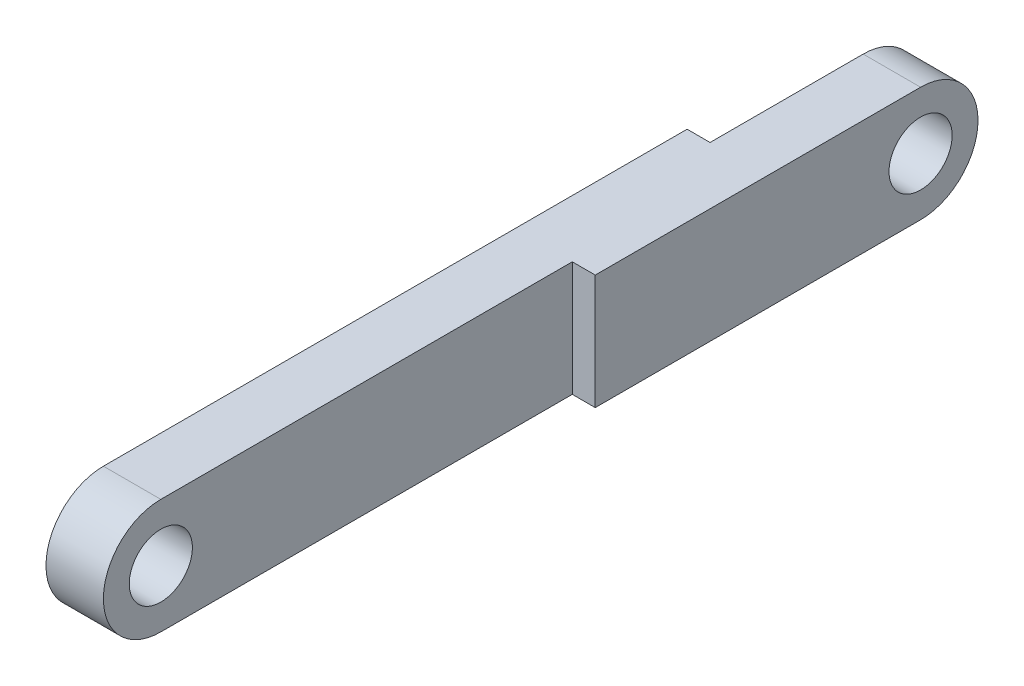
ISO-10303-21;
HEADER;
FILE_DESCRIPTION(('STEP AP214'),'2;1');
FILE_NAME('part.step','',(''),(''),'','','');
FILE_SCHEMA(('AUTOMOTIVE_DESIGN { 1 0 10303 214 1 1 1 1 }'));
ENDSEC;
DATA;
#1=APPLICATION_CONTEXT('core data for automotive mechanical design processes');
#2=APPLICATION_PROTOCOL_DEFINITION('international standard','automotive_design',2000,#1);
#3=PRODUCT_CONTEXT('',#1,'mechanical');
#4=PRODUCT('Part','Part','',(#3));
#5=PRODUCT_RELATED_PRODUCT_CATEGORY('part','',(#4));
#6=PRODUCT_DEFINITION_FORMATION('','',#4);
#7=PRODUCT_DEFINITION_CONTEXT('part definition',#1,'design');
#8=PRODUCT_DEFINITION('design','',#6,#7);
#9=PRODUCT_DEFINITION_SHAPE('','',#8);
#10=(LENGTH_UNIT() NAMED_UNIT(*) SI_UNIT(.MILLI.,.METRE.));
#11=(NAMED_UNIT(*) PLANE_ANGLE_UNIT() SI_UNIT($,.RADIAN.));
#12=(NAMED_UNIT(*) SI_UNIT($,.STERADIAN.) SOLID_ANGLE_UNIT());
#13=UNCERTAINTY_MEASURE_WITH_UNIT(LENGTH_MEASURE(1.E-05),#10,'distance_accuracy_value','');
#14=(GEOMETRIC_REPRESENTATION_CONTEXT(3) GLOBAL_UNCERTAINTY_ASSIGNED_CONTEXT((#13)) GLOBAL_UNIT_ASSIGNED_CONTEXT((#10,
#11,#12)) REPRESENTATION_CONTEXT('',''));
#15=CARTESIAN_POINT('',(0.,0.,0.));
#16=DIRECTION('',(0.,0.,1.));
#17=DIRECTION('',(1.,0.,0.));
#18=AXIS2_PLACEMENT_3D('',#15,#16,#17);
#19=CARTESIAN_POINT('',(3.,0.,0.));
#20=DIRECTION('',(1.,0.,0.));
#21=DIRECTION('',(0.,0.,-1.));
#22=AXIS2_PLACEMENT_3D('',#19,#20,#21);
#23=PLANE('',#22);
#24=DIRECTION('',(0.,-1.,0.));
#25=VECTOR('',#24,1.);
#26=CARTESIAN_POINT('',(3.,0.,-21.5));
#27=LINE('',#26,#25);
#28=CARTESIAN_POINT('',(3.,3.,-21.5));
#29=VERTEX_POINT('',#28);
#30=CARTESIAN_POINT('',(3.,-3.,-21.5));
#31=VERTEX_POINT('',#30);
#32=EDGE_CURVE('E66',#29,#31,#27,.T.);
#33=ORIENTED_EDGE('',*,*,#32,.F.);
#34=DIRECTION('',(0.,0.,1.));
#35=VECTOR('',#34,1.);
#36=CARTESIAN_POINT('',(3.,3.,0.));
#37=LINE('',#36,#35);
#38=CARTESIAN_POINT('',(3.,3.,0.));
#39=VERTEX_POINT('',#38);
#40=EDGE_CURVE('E144',#29,#39,#37,.T.);
#41=ORIENTED_EDGE('',*,*,#40,.T.);
#42=CARTESIAN_POINT('',(3.,0.,0.));
#43=DIRECTION('',(1.,0.,0.));
#44=DIRECTION('',(0.,0.,-1.));
#45=AXIS2_PLACEMENT_3D('',#42,#43,#44);
#46=CIRCLE('',#45,3.);
#47=CARTESIAN_POINT('',(3.,-3.,0.));
#48=VERTEX_POINT('',#47);
#49=EDGE_CURVE('E181',#39,#48,#46,.T.);
#50=ORIENTED_EDGE('',*,*,#49,.T.);
#51=DIRECTION('',(0.,0.,-1.));
#52=VECTOR('',#51,1.);
#53=CARTESIAN_POINT('',(3.,-3.,0.));
#54=LINE('',#53,#52);
#55=EDGE_CURVE('E185',#48,#31,#54,.T.);
#56=ORIENTED_EDGE('',*,*,#55,.T.);
#57=EDGE_LOOP('',(#33,#41,#50,#56));
#58=FACE_BOUND('',#57,.T.);
#59=CARTESIAN_POINT('',(3.,0.,0.));
#60=DIRECTION('',(1.,0.,0.));
#61=DIRECTION('',(0.,0.,-1.));
#62=AXIS2_PLACEMENT_3D('',#59,#60,#61);
#63=CIRCLE('',#62,1.65);
#64=CARTESIAN_POINT('',(3.,0.,-1.65));
#65=VERTEX_POINT('',#64);
#66=EDGE_CURVE('E173',#65,#65,#63,.T.);
#67=ORIENTED_EDGE('',*,*,#66,.F.);
#68=EDGE_LOOP('',(#67));
#69=FACE_BOUND('',#68,.T.);
#70=ADVANCED_FACE('F49',(#58,#69),#23,.T.);
#71=CARTESIAN_POINT('',(0.,0.,0.));
#72=DIRECTION('',(1.,0.,0.));
#73=DIRECTION('',(0.,0.,-1.));
#74=AXIS2_PLACEMENT_3D('',#71,#72,#73);
#75=PLANE('',#74);
#76=DIRECTION('',(0.,0.,1.));
#77=VECTOR('',#76,1.);
#78=CARTESIAN_POINT('',(0.,3.,0.));
#79=LINE('',#78,#77);
#80=CARTESIAN_POINT('',(0.,3.,-30.5));
#81=VERTEX_POINT('',#80);
#82=CARTESIAN_POINT('',(0.,3.,0.));
#83=VERTEX_POINT('',#82);
#84=EDGE_CURVE('E186',#81,#83,#79,.T.);
#85=ORIENTED_EDGE('',*,*,#84,.F.);
#86=DIRECTION('',(0.,1.,0.));
#87=VECTOR('',#86,1.);
#88=CARTESIAN_POINT('',(0.,3.,-30.5));
#89=LINE('',#88,#87);
#90=CARTESIAN_POINT('',(0.,-3.,-30.5));
#91=VERTEX_POINT('',#90);
#92=EDGE_CURVE('E146',#91,#81,#89,.T.);
#93=ORIENTED_EDGE('',*,*,#92,.F.);
#94=DIRECTION('',(0.,0.,-1.));
#95=VECTOR('',#94,1.);
#96=CARTESIAN_POINT('',(0.,-3.,0.));
#97=LINE('',#96,#95);
#98=CARTESIAN_POINT('',(0.,-3.,0.));
#99=VERTEX_POINT('',#98);
#100=EDGE_CURVE('E195',#99,#91,#97,.T.);
#101=ORIENTED_EDGE('',*,*,#100,.F.);
#102=CARTESIAN_POINT('',(0.,0.,0.));
#103=DIRECTION('',(1.,0.,0.));
#104=DIRECTION('',(0.,0.,-1.));
#105=AXIS2_PLACEMENT_3D('',#102,#103,#104);
#106=CIRCLE('',#105,3.);
#107=EDGE_CURVE('E177',#83,#99,#106,.T.);
#108=ORIENTED_EDGE('',*,*,#107,.F.);
#109=EDGE_LOOP('',(#85,#93,#101,#108));
#110=FACE_BOUND('',#109,.T.);
#111=CARTESIAN_POINT('',(0.,0.,0.));
#112=DIRECTION('',(1.,0.,0.));
#113=DIRECTION('',(0.,0.,-1.));
#114=AXIS2_PLACEMENT_3D('',#111,#112,#113);
#115=CIRCLE('',#114,1.65);
#116=CARTESIAN_POINT('',(0.,0.,-1.65));
#117=VERTEX_POINT('',#116);
#118=EDGE_CURVE('E172',#117,#117,#115,.T.);
#119=ORIENTED_EDGE('',*,*,#118,.T.);
#120=EDGE_LOOP('',(#119));
#121=FACE_BOUND('',#120,.T.);
#122=ADVANCED_FACE('F243',(#110,#121),#75,.F.);
#123=CARTESIAN_POINT('',(3.,0.,0.));
#124=DIRECTION('',(-1.,0.,0.));
#125=DIRECTION('',(0.,0.,1.));
#126=AXIS2_PLACEMENT_3D('',#123,#124,#125);
#127=CYLINDRICAL_SURFACE('',#126,3.);
#128=ORIENTED_EDGE('',*,*,#107,.T.);
#129=DIRECTION('',(-1.,0.,0.));
#130=VECTOR('',#129,1.);
#131=CARTESIAN_POINT('',(3.,-3.,0.));
#132=LINE('',#131,#130);
#133=EDGE_CURVE('E11',#48,#99,#132,.T.);
#134=ORIENTED_EDGE('',*,*,#133,.F.);
#135=ORIENTED_EDGE('',*,*,#49,.F.);
#136=DIRECTION('',(-1.,0.,0.));
#137=VECTOR('',#136,1.);
#138=CARTESIAN_POINT('',(3.,3.,0.));
#139=LINE('',#138,#137);
#140=EDGE_CURVE('E191',#39,#83,#139,.T.);
#141=ORIENTED_EDGE('',*,*,#140,.T.);
#142=EDGE_LOOP('',(#128,#134,#135,#141));
#143=FACE_BOUND('',#142,.T.);
#144=ADVANCED_FACE('F51',(#143),#127,.T.);
#145=CARTESIAN_POINT('',(3.,-3.,0.));
#146=DIRECTION('',(0.,1.,0.));
#147=DIRECTION('',(0.,0.,1.));
#148=AXIS2_PLACEMENT_3D('',#145,#146,#147);
#149=PLANE('',#148);
#150=ORIENTED_EDGE('',*,*,#100,.T.);
#151=DIRECTION('',(-1.,0.,0.));
#152=VECTOR('',#151,1.);
#153=CARTESIAN_POINT('',(1.2,-3.,-30.5));
#154=LINE('',#153,#152);
#155=CARTESIAN_POINT('',(1.2,-3.,-30.5));
#156=VERTEX_POINT('',#155);
#157=EDGE_CURVE('E161',#156,#91,#154,.T.);
#158=ORIENTED_EDGE('',*,*,#157,.F.);
#159=DIRECTION('',(0.,0.,1.));
#160=VECTOR('',#159,1.);
#161=CARTESIAN_POINT('',(1.2,-3.,-30.5));
#162=LINE('',#161,#160);
#163=CARTESIAN_POINT('',(1.2,-3.,-38.5));
#164=VERTEX_POINT('',#163);
#165=EDGE_CURVE('E150',#164,#156,#162,.T.);
#166=ORIENTED_EDGE('',*,*,#165,.F.);
#167=DIRECTION('',(-1.,0.,0.));
#168=VECTOR('',#167,1.);
#169=CARTESIAN_POINT('',(3.,-3.,-38.5));
#170=LINE('',#169,#168);
#171=CARTESIAN_POINT('',(4.2,-3.,-38.5));
#172=VERTEX_POINT('',#171);
#173=EDGE_CURVE('E59',#172,#164,#170,.T.);
#174=ORIENTED_EDGE('',*,*,#173,.F.);
#175=DIRECTION('',(0.,0.,-1.));
#176=VECTOR('',#175,1.);
#177=CARTESIAN_POINT('',(4.2,-3.,0.));
#178=LINE('',#177,#176);
#179=CARTESIAN_POINT('',(4.2,-3.,-21.5));
#180=VERTEX_POINT('',#179);
#181=EDGE_CURVE('E128',#180,#172,#178,.T.);
#182=ORIENTED_EDGE('',*,*,#181,.F.);
#183=DIRECTION('',(-1.,0.,0.));
#184=VECTOR('',#183,1.);
#185=CARTESIAN_POINT('',(4.2,-3.,-21.5));
#186=LINE('',#185,#184);
#187=EDGE_CURVE('E123',#180,#31,#186,.T.);
#188=ORIENTED_EDGE('',*,*,#187,.T.);
#189=ORIENTED_EDGE('',*,*,#55,.F.);
#190=ORIENTED_EDGE('',*,*,#133,.T.);
#191=EDGE_LOOP('',(#150,#158,#166,#174,#182,#188,#189,#190));
#192=FACE_BOUND('',#191,.T.);
#193=ADVANCED_FACE('F213',(#192),#149,.F.);
#194=CARTESIAN_POINT('',(3.,0.,-38.5));
#195=DIRECTION('',(-1.,0.,0.));
#196=DIRECTION('',(0.,0.,1.));
#197=AXIS2_PLACEMENT_3D('',#194,#195,#196);
#198=CYLINDRICAL_SURFACE('',#197,3.);
#199=CARTESIAN_POINT('',(1.2,0.,-38.5));
#200=DIRECTION('',(1.,0.,0.));
#201=DIRECTION('',(0.,0.,-1.));
#202=AXIS2_PLACEMENT_3D('',#199,#200,#201);
#203=CIRCLE('',#202,3.);
#204=CARTESIAN_POINT('',(1.2,3.,-38.5));
#205=VERTEX_POINT('',#204);
#206=EDGE_CURVE('E169',#164,#205,#203,.T.);
#207=ORIENTED_EDGE('',*,*,#206,.T.);
#208=DIRECTION('',(-1.,0.,0.));
#209=VECTOR('',#208,1.);
#210=CARTESIAN_POINT('',(3.,3.,-38.5));
#211=LINE('',#210,#209);
#212=CARTESIAN_POINT('',(4.2,3.,-38.5));
#213=VERTEX_POINT('',#212);
#214=EDGE_CURVE('E204',#213,#205,#211,.T.);
#215=ORIENTED_EDGE('',*,*,#214,.F.);
#216=CARTESIAN_POINT('',(4.2,0.,-38.5));
#217=DIRECTION('',(1.,0.,0.));
#218=DIRECTION('',(0.,0.,-1.));
#219=AXIS2_PLACEMENT_3D('',#216,#217,#218);
#220=CIRCLE('',#219,3.);
#221=EDGE_CURVE('E135',#172,#213,#220,.T.);
#222=ORIENTED_EDGE('',*,*,#221,.F.);
#223=ORIENTED_EDGE('',*,*,#173,.T.);
#224=EDGE_LOOP('',(#207,#215,#222,#223));
#225=FACE_BOUND('',#224,.T.);
#226=ADVANCED_FACE('F210',(#225),#198,.T.);
#227=CARTESIAN_POINT('',(3.,3.,0.));
#228=DIRECTION('',(0.,-1.,0.));
#229=DIRECTION('',(0.,0.,-1.));
#230=AXIS2_PLACEMENT_3D('',#227,#228,#229);
#231=PLANE('',#230);
#232=DIRECTION('',(0.,0.,-1.));
#233=VECTOR('',#232,1.);
#234=CARTESIAN_POINT('',(1.2,3.,-41.5));
#235=LINE('',#234,#233);
#236=CARTESIAN_POINT('',(1.2,3.,-30.5));
#237=VERTEX_POINT('',#236);
#238=EDGE_CURVE('E159',#237,#205,#235,.T.);
#239=ORIENTED_EDGE('',*,*,#238,.F.);
#240=DIRECTION('',(-1.,0.,0.));
#241=VECTOR('',#240,1.);
#242=CARTESIAN_POINT('',(1.2,3.,-30.5));
#243=LINE('',#242,#241);
#244=EDGE_CURVE('E163',#237,#81,#243,.T.);
#245=ORIENTED_EDGE('',*,*,#244,.T.);
#246=ORIENTED_EDGE('',*,*,#84,.T.);
#247=ORIENTED_EDGE('',*,*,#140,.F.);
#248=ORIENTED_EDGE('',*,*,#40,.F.);
#249=DIRECTION('',(-1.,0.,0.));
#250=VECTOR('',#249,1.);
#251=CARTESIAN_POINT('',(4.2,3.,-21.5));
#252=LINE('',#251,#250);
#253=CARTESIAN_POINT('',(4.2,3.,-21.5));
#254=VERTEX_POINT('',#253);
#255=EDGE_CURVE('E121',#254,#29,#252,.T.);
#256=ORIENTED_EDGE('',*,*,#255,.F.);
#257=DIRECTION('',(0.,0.,1.));
#258=VECTOR('',#257,1.);
#259=CARTESIAN_POINT('',(4.2,3.,0.));
#260=LINE('',#259,#258);
#261=EDGE_CURVE('E129',#213,#254,#260,.T.);
#262=ORIENTED_EDGE('',*,*,#261,.F.);
#263=ORIENTED_EDGE('',*,*,#214,.T.);
#264=EDGE_LOOP('',(#239,#245,#246,#247,#248,#256,#262,#263));
#265=FACE_BOUND('',#264,.T.);
#266=ADVANCED_FACE('F142',(#265),#231,.F.);
#267=CARTESIAN_POINT('',(3.,0.,-38.5));
#268=DIRECTION('',(-1.,0.,0.));
#269=DIRECTION('',(0.,0.,1.));
#270=AXIS2_PLACEMENT_3D('',#267,#268,#269);
#271=CYLINDRICAL_SURFACE('',#270,1.65);
#272=CARTESIAN_POINT('',(1.2,0.,-38.5));
#273=DIRECTION('',(1.,0.,0.));
#274=DIRECTION('',(0.,0.,-1.));
#275=AXIS2_PLACEMENT_3D('',#272,#273,#274);
#276=CIRCLE('',#275,1.65);
#277=CARTESIAN_POINT('',(1.2,0.,-40.15));
#278=VERTEX_POINT('',#277);
#279=EDGE_CURVE('E53',#278,#278,#276,.T.);
#280=ORIENTED_EDGE('',*,*,#279,.F.);
#281=EDGE_LOOP('',(#280));
#282=FACE_BOUND('',#281,.T.);
#283=CARTESIAN_POINT('',(4.2,0.,-38.5));
#284=DIRECTION('',(1.,0.,0.));
#285=DIRECTION('',(0.,0.,-1.));
#286=AXIS2_PLACEMENT_3D('',#283,#284,#285);
#287=CIRCLE('',#286,1.65);
#288=CARTESIAN_POINT('',(4.2,0.,-40.15));
#289=VERTEX_POINT('',#288);
#290=EDGE_CURVE('E139',#289,#289,#287,.F.);
#291=ORIENTED_EDGE('',*,*,#290,.F.);
#292=EDGE_LOOP('',(#291));
#293=FACE_BOUND('',#292,.T.);
#294=ADVANCED_FACE('F226',(#282,#293),#271,.F.);
#295=CARTESIAN_POINT('',(3.,0.,0.));
#296=DIRECTION('',(-1.,0.,0.));
#297=DIRECTION('',(0.,0.,1.));
#298=AXIS2_PLACEMENT_3D('',#295,#296,#297);
#299=CYLINDRICAL_SURFACE('',#298,1.65);
#300=ORIENTED_EDGE('',*,*,#66,.T.);
#301=EDGE_LOOP('',(#300));
#302=FACE_BOUND('',#301,.T.);
#303=ORIENTED_EDGE('',*,*,#118,.F.);
#304=EDGE_LOOP('',(#303));
#305=FACE_BOUND('',#304,.T.);
#306=ADVANCED_FACE('F228',(#302,#305),#299,.F.);
#307=CARTESIAN_POINT('',(1.2,0.,0.));
#308=DIRECTION('',(1.,0.,0.));
#309=DIRECTION('',(0.,0.,-1.));
#310=AXIS2_PLACEMENT_3D('',#307,#308,#309);
#311=PLANE('',#310);
#312=ORIENTED_EDGE('',*,*,#279,.T.);
#313=EDGE_LOOP('',(#312));
#314=FACE_BOUND('',#313,.T.);
#315=ORIENTED_EDGE('',*,*,#206,.F.);
#316=ORIENTED_EDGE('',*,*,#165,.T.);
#317=DIRECTION('',(0.,1.,0.));
#318=VECTOR('',#317,1.);
#319=CARTESIAN_POINT('',(1.2,3.,-30.5));
#320=LINE('',#319,#318);
#321=EDGE_CURVE('E74',#156,#237,#320,.T.);
#322=ORIENTED_EDGE('',*,*,#321,.T.);
#323=ORIENTED_EDGE('',*,*,#238,.T.);
#324=EDGE_LOOP('',(#315,#316,#322,#323));
#325=FACE_BOUND('',#324,.T.);
#326=ADVANCED_FACE('F236',(#314,#325),#311,.F.);
#327=CARTESIAN_POINT('',(1.2,3.,-30.5));
#328=DIRECTION('',(0.,0.,1.));
#329=DIRECTION('',(1.,0.,0.));
#330=AXIS2_PLACEMENT_3D('',#327,#328,#329);
#331=PLANE('',#330);
#332=ORIENTED_EDGE('',*,*,#92,.T.);
#333=ORIENTED_EDGE('',*,*,#244,.F.);
#334=ORIENTED_EDGE('',*,*,#321,.F.);
#335=ORIENTED_EDGE('',*,*,#157,.T.);
#336=EDGE_LOOP('',(#332,#333,#334,#335));
#337=FACE_BOUND('',#336,.T.);
#338=ADVANCED_FACE('F267',(#337),#331,.F.);
#339=CARTESIAN_POINT('',(4.2,0.,-21.5));
#340=DIRECTION('',(0.,0.,-1.));
#341=DIRECTION('',(-1.,0.,0.));
#342=AXIS2_PLACEMENT_3D('',#339,#340,#341);
#343=PLANE('',#342);
#344=ORIENTED_EDGE('',*,*,#32,.T.);
#345=ORIENTED_EDGE('',*,*,#187,.F.);
#346=DIRECTION('',(0.,-1.,0.));
#347=VECTOR('',#346,1.);
#348=CARTESIAN_POINT('',(4.2,0.,-21.5));
#349=LINE('',#348,#347);
#350=EDGE_CURVE('E117',#254,#180,#349,.T.);
#351=ORIENTED_EDGE('',*,*,#350,.F.);
#352=ORIENTED_EDGE('',*,*,#255,.T.);
#353=EDGE_LOOP('',(#344,#345,#351,#352));
#354=FACE_BOUND('',#353,.T.);
#355=ADVANCED_FACE('F119',(#354),#343,.F.);
#356=CARTESIAN_POINT('',(4.2,0.,0.));
#357=DIRECTION('',(1.,0.,0.));
#358=DIRECTION('',(0.,0.,-1.));
#359=AXIS2_PLACEMENT_3D('',#356,#357,#358);
#360=PLANE('',#359);
#361=ORIENTED_EDGE('',*,*,#290,.T.);
#362=EDGE_LOOP('',(#361));
#363=FACE_BOUND('',#362,.T.);
#364=ORIENTED_EDGE('',*,*,#261,.T.);
#365=ORIENTED_EDGE('',*,*,#350,.T.);
#366=ORIENTED_EDGE('',*,*,#181,.T.);
#367=ORIENTED_EDGE('',*,*,#221,.T.);
#368=EDGE_LOOP('',(#364,#365,#366,#367));
#369=FACE_BOUND('',#368,.T.);
#370=ADVANCED_FACE('F133',(#363,#369),#360,.T.);
#371=CLOSED_SHELL('',(#70,#122,#144,#193,#226,#266,#294,#306,#326,#338,#355,#370));
#372=MANIFOLD_SOLID_BREP('B2',#371);
#373=ADVANCED_BREP_SHAPE_REPRESENTATION('',(#18,#372),#14);
#374=SHAPE_DEFINITION_REPRESENTATION(#9,#373);
ENDSEC;
END-ISO-10303-21;
